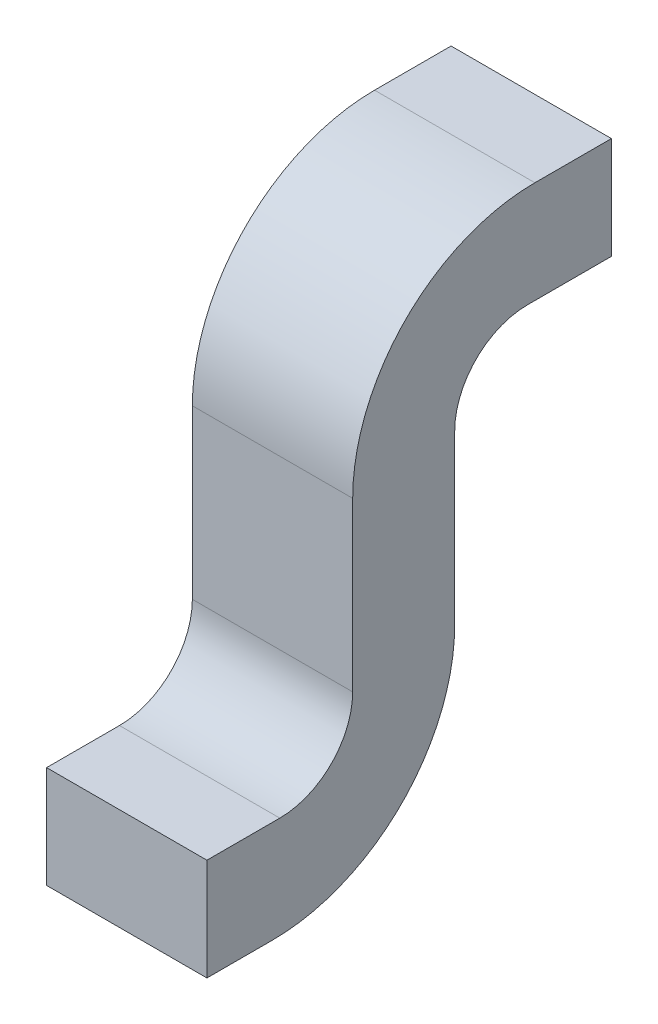
ISO-10303-21;
HEADER;
FILE_DESCRIPTION(('STEP AP214'),'2;1');
FILE_NAME('part.step','',(''),(''),'','','');
FILE_SCHEMA(('AUTOMOTIVE_DESIGN { 1 0 10303 214 1 1 1 1 }'));
ENDSEC;
DATA;
#1=APPLICATION_CONTEXT('core data for automotive mechanical design processes');
#2=APPLICATION_PROTOCOL_DEFINITION('international standard','automotive_design',2000,#1);
#3=PRODUCT_CONTEXT('',#1,'mechanical');
#4=PRODUCT('Part','Part','',(#3));
#5=PRODUCT_RELATED_PRODUCT_CATEGORY('part','',(#4));
#6=PRODUCT_DEFINITION_FORMATION('','',#4);
#7=PRODUCT_DEFINITION_CONTEXT('part definition',#1,'design');
#8=PRODUCT_DEFINITION('design','',#6,#7);
#9=PRODUCT_DEFINITION_SHAPE('','',#8);
#10=(LENGTH_UNIT() NAMED_UNIT(*) SI_UNIT(.MILLI.,.METRE.));
#11=(NAMED_UNIT(*) PLANE_ANGLE_UNIT() SI_UNIT($,.RADIAN.));
#12=(NAMED_UNIT(*) SI_UNIT($,.STERADIAN.) SOLID_ANGLE_UNIT());
#13=UNCERTAINTY_MEASURE_WITH_UNIT(LENGTH_MEASURE(1.E-05),#10,'distance_accuracy_value','');
#14=(GEOMETRIC_REPRESENTATION_CONTEXT(3) GLOBAL_UNCERTAINTY_ASSIGNED_CONTEXT((#13)) GLOBAL_UNIT_ASSIGNED_CONTEXT((#10,
#11,#12)) REPRESENTATION_CONTEXT('',''));
#15=CARTESIAN_POINT('',(0.,0.,0.));
#16=DIRECTION('',(0.,0.,1.));
#17=DIRECTION('',(1.,0.,0.));
#18=AXIS2_PLACEMENT_3D('',#15,#16,#17);
#19=CARTESIAN_POINT('',(-0.54,0.165,0.545));
#20=DIRECTION('',(-1.,0.,0.));
#21=DIRECTION('',(0.,1.,0.));
#22=AXIS2_PLACEMENT_3D('',#19,#20,#21);
#23=PLANE('',#22);
#24=DIRECTION('',(0.,1.,0.));
#25=VECTOR('',#24,1.);
#26=CARTESIAN_POINT('',(-0.54,0.165,1.1));
#27=LINE('',#26,#25);
#28=CARTESIAN_POINT('',(-0.54,-0.485,1.1));
#29=VERTEX_POINT('',#28);
#30=CARTESIAN_POINT('',(-0.54,-0.345,1.1));
#31=VERTEX_POINT('',#30);
#32=EDGE_CURVE('E146',#29,#31,#27,.T.);
#33=ORIENTED_EDGE('',*,*,#32,.F.);
#34=DIRECTION('',(0.,0.,1.));
#35=VECTOR('',#34,1.);
#36=CARTESIAN_POINT('',(-0.54,-0.485,0.545));
#37=LINE('',#36,#35);
#38=CARTESIAN_POINT('',(-0.54,-0.485,1.01));
#39=VERTEX_POINT('',#38);
#40=EDGE_CURVE('E141',#39,#29,#37,.T.);
#41=ORIENTED_EDGE('',*,*,#40,.F.);
#42=CARTESIAN_POINT('',(-0.54,-0.235,1.01));
#43=DIRECTION('',(-1.,0.,0.));
#44=DIRECTION('',(0.,0.,1.));
#45=AXIS2_PLACEMENT_3D('',#42,#43,#44);
#46=CIRCLE('',#45,0.25);
#47=CARTESIAN_POINT('',(-0.54,-0.235,0.76));
#48=VERTEX_POINT('',#47);
#49=EDGE_CURVE('E143',#48,#39,#46,.T.);
#50=ORIENTED_EDGE('',*,*,#49,.F.);
#51=DIRECTION('',(0.,-1.,0.));
#52=VECTOR('',#51,1.);
#53=CARTESIAN_POINT('',(-0.54,0.165,0.76));
#54=LINE('',#53,#52);
#55=CARTESIAN_POINT('',(-0.54,-0.004999999999999,0.76));
#56=VERTEX_POINT('',#55);
#57=EDGE_CURVE('E136',#56,#48,#54,.T.);
#58=ORIENTED_EDGE('',*,*,#57,.F.);
#59=CARTESIAN_POINT('',(-0.54,-0.004999999999999,0.66));
#60=DIRECTION('',(1.,0.,0.));
#61=DIRECTION('',(0.,0.,1.));
#62=AXIS2_PLACEMENT_3D('',#59,#60,#61);
#63=CIRCLE('',#62,0.1);
#64=CARTESIAN_POINT('',(-0.54,0.095,0.66));
#65=VERTEX_POINT('',#64);
#66=EDGE_CURVE('E128',#65,#56,#63,.T.);
#67=ORIENTED_EDGE('',*,*,#66,.F.);
#68=DIRECTION('',(0.,0.,1.));
#69=VECTOR('',#68,1.);
#70=CARTESIAN_POINT('',(-0.54,0.095,0.545));
#71=LINE('',#70,#69);
#72=CARTESIAN_POINT('',(-0.54,0.095,0.545));
#73=VERTEX_POINT('',#72);
#74=EDGE_CURVE('E122',#73,#65,#71,.T.);
#75=ORIENTED_EDGE('',*,*,#74,.F.);
#76=DIRECTION('',(0.,-1.,0.));
#77=VECTOR('',#76,1.);
#78=CARTESIAN_POINT('',(-0.54,0.165,0.545));
#79=LINE('',#78,#77);
#80=CARTESIAN_POINT('',(-0.54,0.235,0.545));
#81=VERTEX_POINT('',#80);
#82=EDGE_CURVE('E176',#81,#73,#79,.T.);
#83=ORIENTED_EDGE('',*,*,#82,.F.);
#84=DIRECTION('',(0.,0.,-1.));
#85=VECTOR('',#84,1.);
#86=CARTESIAN_POINT('',(-0.54,0.235,0.545));
#87=LINE('',#86,#85);
#88=CARTESIAN_POINT('',(-0.54,0.235,0.65));
#89=VERTEX_POINT('',#88);
#90=EDGE_CURVE('E252',#89,#81,#87,.T.);
#91=ORIENTED_EDGE('',*,*,#90,.F.);
#92=CARTESIAN_POINT('',(-0.54,-0.015,0.65));
#93=DIRECTION('',(-1.,0.,0.));
#94=DIRECTION('',(0.,0.,1.));
#95=AXIS2_PLACEMENT_3D('',#92,#93,#94);
#96=CIRCLE('',#95,0.25);
#97=CARTESIAN_POINT('',(-0.54,-0.015,0.9));
#98=VERTEX_POINT('',#97);
#99=EDGE_CURVE('E232',#98,#89,#96,.T.);
#100=ORIENTED_EDGE('',*,*,#99,.F.);
#101=DIRECTION('',(0.,1.,0.));
#102=VECTOR('',#101,1.);
#103=CARTESIAN_POINT('',(-0.54,0.165,0.9));
#104=LINE('',#103,#102);
#105=CARTESIAN_POINT('',(-0.54,-0.245,0.9));
#106=VERTEX_POINT('',#105);
#107=EDGE_CURVE('E238',#106,#98,#104,.T.);
#108=ORIENTED_EDGE('',*,*,#107,.F.);
#109=CARTESIAN_POINT('',(-0.54,-0.245,1.));
#110=DIRECTION('',(1.,0.,0.));
#111=DIRECTION('',(0.,0.,1.));
#112=AXIS2_PLACEMENT_3D('',#109,#110,#111);
#113=CIRCLE('',#112,0.1);
#114=CARTESIAN_POINT('',(-0.54,-0.345,1.));
#115=VERTEX_POINT('',#114);
#116=EDGE_CURVE('E239',#115,#106,#113,.T.);
#117=ORIENTED_EDGE('',*,*,#116,.F.);
#118=DIRECTION('',(0.,0.,-1.));
#119=VECTOR('',#118,1.);
#120=CARTESIAN_POINT('',(-0.54,-0.345,0.545));
#121=LINE('',#120,#119);
#122=EDGE_CURVE('E11',#31,#115,#121,.T.);
#123=ORIENTED_EDGE('',*,*,#122,.F.);
#124=EDGE_LOOP('',(#33,#41,#50,#58,#67,#75,#83,#91,#100,#108,#117,#123));
#125=FACE_BOUND('',#124,.T.);
#126=ADVANCED_FACE('F16',(#125),#23,.F.);
#127=CARTESIAN_POINT('',(-0.76,-0.345,1.05));
#128=DIRECTION('',(0.,1.,0.));
#129=DIRECTION('',(0.,0.,-1.));
#130=AXIS2_PLACEMENT_3D('',#127,#128,#129);
#131=PLANE('',#130);
#132=DIRECTION('',(0.,0.,1.));
#133=VECTOR('',#132,1.);
#134=CARTESIAN_POINT('',(-0.76,-0.345,1.05));
#135=LINE('',#134,#133);
#136=CARTESIAN_POINT('',(-0.76,-0.345,1.));
#137=VERTEX_POINT('',#136);
#138=CARTESIAN_POINT('',(-0.76,-0.345,1.1));
#139=VERTEX_POINT('',#138);
#140=EDGE_CURVE('E184',#137,#139,#135,.T.);
#141=ORIENTED_EDGE('',*,*,#140,.T.);
#142=DIRECTION('',(1.,0.,0.));
#143=VECTOR('',#142,1.);
#144=CARTESIAN_POINT('',(-0.76,-0.345,1.1));
#145=LINE('',#144,#143);
#146=EDGE_CURVE('E27',#139,#31,#145,.T.);
#147=ORIENTED_EDGE('',*,*,#146,.T.);
#148=ORIENTED_EDGE('',*,*,#122,.T.);
#149=DIRECTION('',(-1.,0.,0.));
#150=VECTOR('',#149,1.);
#151=CARTESIAN_POINT('',(-0.76,-0.345,1.));
#152=LINE('',#151,#150);
#153=EDGE_CURVE('E242',#115,#137,#152,.T.);
#154=ORIENTED_EDGE('',*,*,#153,.T.);
#155=EDGE_LOOP('',(#141,#147,#148,#154));
#156=FACE_BOUND('',#155,.T.);
#157=ADVANCED_FACE('F312',(#156),#131,.T.);
#158=CARTESIAN_POINT('',(-0.76,-0.415,1.1));
#159=DIRECTION('',(0.,0.,1.));
#160=DIRECTION('',(1.,0.,0.));
#161=AXIS2_PLACEMENT_3D('',#158,#159,#160);
#162=PLANE('',#161);
#163=DIRECTION('',(0.,-1.,0.));
#164=VECTOR('',#163,1.);
#165=CARTESIAN_POINT('',(-0.76,-0.415,1.1));
#166=LINE('',#165,#164);
#167=CARTESIAN_POINT('',(-0.76,-0.485,1.1));
#168=VERTEX_POINT('',#167);
#169=EDGE_CURVE('E189',#139,#168,#166,.T.);
#170=ORIENTED_EDGE('',*,*,#169,.T.);
#171=DIRECTION('',(1.,0.,0.));
#172=VECTOR('',#171,1.);
#173=CARTESIAN_POINT('',(-0.76,-0.485,1.1));
#174=LINE('',#173,#172);
#175=EDGE_CURVE('E151',#168,#29,#174,.T.);
#176=ORIENTED_EDGE('',*,*,#175,.T.);
#177=ORIENTED_EDGE('',*,*,#32,.T.);
#178=ORIENTED_EDGE('',*,*,#146,.F.);
#179=EDGE_LOOP('',(#170,#176,#177,#178));
#180=FACE_BOUND('',#179,.T.);
#181=ADVANCED_FACE('F317',(#180),#162,.T.);
#182=CARTESIAN_POINT('',(-0.76,-0.485,1.055));
#183=DIRECTION('',(0.,-1.,0.));
#184=DIRECTION('',(0.,0.,-1.));
#185=AXIS2_PLACEMENT_3D('',#182,#183,#184);
#186=PLANE('',#185);
#187=DIRECTION('',(0.,0.,-1.));
#188=VECTOR('',#187,1.);
#189=CARTESIAN_POINT('',(-0.76,-0.485,1.055));
#190=LINE('',#189,#188);
#191=CARTESIAN_POINT('',(-0.76,-0.485,1.01));
#192=VERTEX_POINT('',#191);
#193=EDGE_CURVE('E162',#168,#192,#190,.T.);
#194=ORIENTED_EDGE('',*,*,#193,.T.);
#195=DIRECTION('',(1.,0.,0.));
#196=VECTOR('',#195,1.);
#197=CARTESIAN_POINT('',(-0.76,-0.485,1.01));
#198=LINE('',#197,#196);
#199=EDGE_CURVE('E20',#192,#39,#198,.T.);
#200=ORIENTED_EDGE('',*,*,#199,.T.);
#201=ORIENTED_EDGE('',*,*,#40,.T.);
#202=ORIENTED_EDGE('',*,*,#175,.F.);
#203=EDGE_LOOP('',(#194,#200,#201,#202));
#204=FACE_BOUND('',#203,.T.);
#205=ADVANCED_FACE('F160',(#204),#186,.T.);
#206=CARTESIAN_POINT('',(-0.76,-0.235,1.01));
#207=DIRECTION('',(-1.,0.,0.));
#208=DIRECTION('',(0.,0.,1.));
#209=AXIS2_PLACEMENT_3D('',#206,#207,#208);
#210=CYLINDRICAL_SURFACE('',#209,0.25);
#211=ORIENTED_EDGE('',*,*,#199,.F.);
#212=CARTESIAN_POINT('',(-0.76,-0.235,1.01));
#213=DIRECTION('',(1.,0.,0.));
#214=DIRECTION('',(0.,0.,1.));
#215=AXIS2_PLACEMENT_3D('',#212,#213,#214);
#216=CIRCLE('',#215,0.25);
#217=CARTESIAN_POINT('',(-0.76,-0.235,0.76));
#218=VERTEX_POINT('',#217);
#219=EDGE_CURVE('E225',#192,#218,#216,.T.);
#220=ORIENTED_EDGE('',*,*,#219,.T.);
#221=DIRECTION('',(1.,0.,0.));
#222=VECTOR('',#221,1.);
#223=CARTESIAN_POINT('',(-0.76,-0.235,0.76));
#224=LINE('',#223,#222);
#225=EDGE_CURVE('E157',#218,#48,#224,.T.);
#226=ORIENTED_EDGE('',*,*,#225,.T.);
#227=ORIENTED_EDGE('',*,*,#49,.T.);
#228=EDGE_LOOP('',(#211,#220,#226,#227));
#229=FACE_BOUND('',#228,.T.);
#230=ADVANCED_FACE('F154',(#229),#210,.T.);
#231=CARTESIAN_POINT('',(-0.76,-0.12,0.76));
#232=DIRECTION('',(0.,0.,-1.));
#233=DIRECTION('',(-1.,0.,0.));
#234=AXIS2_PLACEMENT_3D('',#231,#232,#233);
#235=PLANE('',#234);
#236=DIRECTION('',(0.,1.,0.));
#237=VECTOR('',#236,1.);
#238=CARTESIAN_POINT('',(-0.76,-0.12,0.76));
#239=LINE('',#238,#237);
#240=CARTESIAN_POINT('',(-0.76,-0.004999999999999,0.76));
#241=VERTEX_POINT('',#240);
#242=EDGE_CURVE('E193',#218,#241,#239,.T.);
#243=ORIENTED_EDGE('',*,*,#242,.T.);
#244=DIRECTION('',(1.,0.,0.));
#245=VECTOR('',#244,1.);
#246=CARTESIAN_POINT('',(-0.76,-0.004999999999998,0.76));
#247=LINE('',#246,#245);
#248=EDGE_CURVE('E173',#241,#56,#247,.T.);
#249=ORIENTED_EDGE('',*,*,#248,.T.);
#250=ORIENTED_EDGE('',*,*,#57,.T.);
#251=ORIENTED_EDGE('',*,*,#225,.F.);
#252=EDGE_LOOP('',(#243,#249,#250,#251));
#253=FACE_BOUND('',#252,.T.);
#254=ADVANCED_FACE('F290',(#253),#235,.T.);
#255=CARTESIAN_POINT('',(-0.76,-0.004999999999999,0.66));
#256=DIRECTION('',(-1.,0.,0.));
#257=DIRECTION('',(0.,0.,1.));
#258=AXIS2_PLACEMENT_3D('',#255,#256,#257);
#259=CYLINDRICAL_SURFACE('',#258,0.1);
#260=DIRECTION('',(-1.,0.,0.));
#261=VECTOR('',#260,1.);
#262=CARTESIAN_POINT('',(-0.76,0.095,0.66));
#263=LINE('',#262,#261);
#264=CARTESIAN_POINT('',(-0.76,0.095,0.66));
#265=VERTEX_POINT('',#264);
#266=EDGE_CURVE('E181',#65,#265,#263,.T.);
#267=ORIENTED_EDGE('',*,*,#266,.F.);
#268=ORIENTED_EDGE('',*,*,#66,.T.);
#269=ORIENTED_EDGE('',*,*,#248,.F.);
#270=CARTESIAN_POINT('',(-0.76,-0.004999999999999,0.66));
#271=DIRECTION('',(1.,0.,0.));
#272=DIRECTION('',(0.,0.,1.));
#273=AXIS2_PLACEMENT_3D('',#270,#271,#272);
#274=CIRCLE('',#273,0.1);
#275=EDGE_CURVE('E190',#265,#241,#274,.T.);
#276=ORIENTED_EDGE('',*,*,#275,.F.);
#277=EDGE_LOOP('',(#267,#268,#269,#276));
#278=FACE_BOUND('',#277,.T.);
#279=ADVANCED_FACE('F296',(#278),#259,.F.);
#280=CARTESIAN_POINT('',(-0.76,0.095,0.6025));
#281=DIRECTION('',(0.,-1.,0.));
#282=DIRECTION('',(0.,0.,-1.));
#283=AXIS2_PLACEMENT_3D('',#280,#281,#282);
#284=PLANE('',#283);
#285=DIRECTION('',(0.,0.,-1.));
#286=VECTOR('',#285,1.);
#287=CARTESIAN_POINT('',(-0.76,0.095,0.6025));
#288=LINE('',#287,#286);
#289=CARTESIAN_POINT('',(-0.76,0.095,0.545));
#290=VERTEX_POINT('',#289);
#291=EDGE_CURVE('E194',#265,#290,#288,.T.);
#292=ORIENTED_EDGE('',*,*,#291,.T.);
#293=DIRECTION('',(1.,0.,0.));
#294=VECTOR('',#293,1.);
#295=CARTESIAN_POINT('',(-0.76,0.095,0.545));
#296=LINE('',#295,#294);
#297=EDGE_CURVE('E228',#290,#73,#296,.T.);
#298=ORIENTED_EDGE('',*,*,#297,.T.);
#299=ORIENTED_EDGE('',*,*,#74,.T.);
#300=ORIENTED_EDGE('',*,*,#266,.T.);
#301=EDGE_LOOP('',(#292,#298,#299,#300));
#302=FACE_BOUND('',#301,.T.);
#303=ADVANCED_FACE('F298',(#302),#284,.T.);
#304=CARTESIAN_POINT('',(-0.76,0.165,0.545));
#305=DIRECTION('',(0.,0.,-1.));
#306=DIRECTION('',(-1.,0.,0.));
#307=AXIS2_PLACEMENT_3D('',#304,#305,#306);
#308=PLANE('',#307);
#309=DIRECTION('',(0.,1.,0.));
#310=VECTOR('',#309,1.);
#311=CARTESIAN_POINT('',(-0.76,0.165,0.545));
#312=LINE('',#311,#310);
#313=CARTESIAN_POINT('',(-0.76,0.235,0.545));
#314=VERTEX_POINT('',#313);
#315=EDGE_CURVE('E198',#290,#314,#312,.T.);
#316=ORIENTED_EDGE('',*,*,#315,.T.);
#317=DIRECTION('',(1.,0.,0.));
#318=VECTOR('',#317,1.);
#319=CARTESIAN_POINT('',(-0.76,0.235,0.545));
#320=LINE('',#319,#318);
#321=EDGE_CURVE('E255',#314,#81,#320,.T.);
#322=ORIENTED_EDGE('',*,*,#321,.T.);
#323=ORIENTED_EDGE('',*,*,#82,.T.);
#324=ORIENTED_EDGE('',*,*,#297,.F.);
#325=EDGE_LOOP('',(#316,#322,#323,#324));
#326=FACE_BOUND('',#325,.T.);
#327=ADVANCED_FACE('F299',(#326),#308,.T.);
#328=CARTESIAN_POINT('',(-0.76,0.235,0.5975));
#329=DIRECTION('',(0.,1.,0.));
#330=DIRECTION('',(1.,0.,0.));
#331=AXIS2_PLACEMENT_3D('',#328,#329,#330);
#332=PLANE('',#331);
#333=DIRECTION('',(0.,0.,1.));
#334=VECTOR('',#333,1.);
#335=CARTESIAN_POINT('',(-0.76,0.235,0.5975));
#336=LINE('',#335,#334);
#337=CARTESIAN_POINT('',(-0.76,0.235,0.65));
#338=VERTEX_POINT('',#337);
#339=EDGE_CURVE('E195',#314,#338,#336,.T.);
#340=ORIENTED_EDGE('',*,*,#339,.T.);
#341=DIRECTION('',(1.,0.,0.));
#342=VECTOR('',#341,1.);
#343=CARTESIAN_POINT('',(-0.76,0.235,0.65));
#344=LINE('',#343,#342);
#345=EDGE_CURVE('E229',#338,#89,#344,.T.);
#346=ORIENTED_EDGE('',*,*,#345,.T.);
#347=ORIENTED_EDGE('',*,*,#90,.T.);
#348=ORIENTED_EDGE('',*,*,#321,.F.);
#349=EDGE_LOOP('',(#340,#346,#347,#348));
#350=FACE_BOUND('',#349,.T.);
#351=ADVANCED_FACE('F18',(#350),#332,.T.);
#352=CARTESIAN_POINT('',(-0.76,-0.015,0.65));
#353=DIRECTION('',(-1.,0.,0.));
#354=DIRECTION('',(0.,0.,1.));
#355=AXIS2_PLACEMENT_3D('',#352,#353,#354);
#356=CYLINDRICAL_SURFACE('',#355,0.25);
#357=ORIENTED_EDGE('',*,*,#345,.F.);
#358=CARTESIAN_POINT('',(-0.76,-0.015,0.65));
#359=DIRECTION('',(1.,0.,0.));
#360=DIRECTION('',(0.,0.,1.));
#361=AXIS2_PLACEMENT_3D('',#358,#359,#360);
#362=CIRCLE('',#361,0.25);
#363=CARTESIAN_POINT('',(-0.76,-0.015,0.9));
#364=VERTEX_POINT('',#363);
#365=EDGE_CURVE('E199',#338,#364,#362,.T.);
#366=ORIENTED_EDGE('',*,*,#365,.T.);
#367=DIRECTION('',(1.,0.,0.));
#368=VECTOR('',#367,1.);
#369=CARTESIAN_POINT('',(-0.76,-0.015,0.9));
#370=LINE('',#369,#368);
#371=EDGE_CURVE('E233',#364,#98,#370,.T.);
#372=ORIENTED_EDGE('',*,*,#371,.T.);
#373=ORIENTED_EDGE('',*,*,#99,.T.);
#374=EDGE_LOOP('',(#357,#366,#372,#373));
#375=FACE_BOUND('',#374,.T.);
#376=ADVANCED_FACE('F300',(#375),#356,.T.);
#377=CARTESIAN_POINT('',(-0.76,-0.13,0.9));
#378=DIRECTION('',(0.,0.,1.));
#379=DIRECTION('',(1.,0.,0.));
#380=AXIS2_PLACEMENT_3D('',#377,#378,#379);
#381=PLANE('',#380);
#382=DIRECTION('',(0.,-1.,0.));
#383=VECTOR('',#382,1.);
#384=CARTESIAN_POINT('',(-0.76,-0.13,0.9));
#385=LINE('',#384,#383);
#386=CARTESIAN_POINT('',(-0.76,-0.245,0.9));
#387=VERTEX_POINT('',#386);
#388=EDGE_CURVE('E211',#364,#387,#385,.T.);
#389=ORIENTED_EDGE('',*,*,#388,.T.);
#390=DIRECTION('',(1.,0.,0.));
#391=VECTOR('',#390,1.);
#392=CARTESIAN_POINT('',(-0.76,-0.245,0.9));
#393=LINE('',#392,#391);
#394=EDGE_CURVE('E234',#387,#106,#393,.T.);
#395=ORIENTED_EDGE('',*,*,#394,.T.);
#396=ORIENTED_EDGE('',*,*,#107,.T.);
#397=ORIENTED_EDGE('',*,*,#371,.F.);
#398=EDGE_LOOP('',(#389,#395,#396,#397));
#399=FACE_BOUND('',#398,.T.);
#400=ADVANCED_FACE('F308',(#399),#381,.T.);
#401=CARTESIAN_POINT('',(-0.76,-0.245,1.));
#402=DIRECTION('',(-1.,0.,0.));
#403=DIRECTION('',(0.,0.,1.));
#404=AXIS2_PLACEMENT_3D('',#401,#402,#403);
#405=CYLINDRICAL_SURFACE('',#404,0.1);
#406=ORIENTED_EDGE('',*,*,#153,.F.);
#407=ORIENTED_EDGE('',*,*,#116,.T.);
#408=ORIENTED_EDGE('',*,*,#394,.F.);
#409=CARTESIAN_POINT('',(-0.76,-0.245,1.));
#410=DIRECTION('',(1.,0.,0.));
#411=DIRECTION('',(0.,0.,1.));
#412=AXIS2_PLACEMENT_3D('',#409,#410,#411);
#413=CIRCLE('',#412,0.1);
#414=EDGE_CURVE('E188',#137,#387,#413,.T.);
#415=ORIENTED_EDGE('',*,*,#414,.F.);
#416=EDGE_LOOP('',(#406,#407,#408,#415));
#417=FACE_BOUND('',#416,.T.);
#418=ADVANCED_FACE('F347',(#417),#405,.F.);
#419=CARTESIAN_POINT('',(-0.76,-0.121132572617,0.825365755119));
#420=DIRECTION('',(-1.,0.,0.));
#421=DIRECTION('',(0.,1.,0.));
#422=AXIS2_PLACEMENT_3D('',#419,#420,#421);
#423=PLANE('',#422);
#424=ORIENTED_EDGE('',*,*,#219,.F.);
#425=ORIENTED_EDGE('',*,*,#193,.F.);
#426=ORIENTED_EDGE('',*,*,#169,.F.);
#427=ORIENTED_EDGE('',*,*,#140,.F.);
#428=ORIENTED_EDGE('',*,*,#414,.T.);
#429=ORIENTED_EDGE('',*,*,#388,.F.);
#430=ORIENTED_EDGE('',*,*,#365,.F.);
#431=ORIENTED_EDGE('',*,*,#339,.F.);
#432=ORIENTED_EDGE('',*,*,#315,.F.);
#433=ORIENTED_EDGE('',*,*,#291,.F.);
#434=ORIENTED_EDGE('',*,*,#275,.T.);
#435=ORIENTED_EDGE('',*,*,#242,.F.);
#436=EDGE_LOOP('',(#424,#425,#426,#427,#428,#429,#430,#431,#432,#433,#434,#435));
#437=FACE_BOUND('',#436,.T.);
#438=ADVANCED_FACE('F294',(#437),#423,.T.);
#439=CLOSED_SHELL('',(#126,#157,#181,#205,#230,#254,#279,#303,#327,#351,#376,#400,#418,#438));
#440=MANIFOLD_SOLID_BREP('B1',#439);
#441=ADVANCED_BREP_SHAPE_REPRESENTATION('',(#18,#440),#14);
#442=SHAPE_DEFINITION_REPRESENTATION(#9,#441);
ENDSEC;
END-ISO-10303-21;
